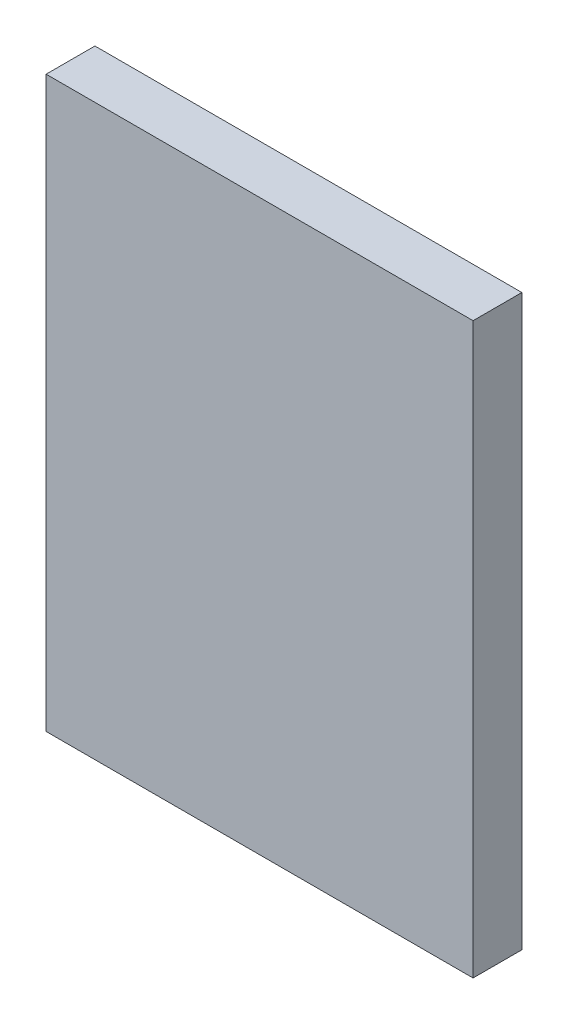
ISO-10303-21;
HEADER;
FILE_DESCRIPTION(('STEP AP214'),'2;1');
FILE_NAME('part.step','',(''),(''),'','','');
FILE_SCHEMA(('AUTOMOTIVE_DESIGN { 1 0 10303 214 1 1 1 1 }'));
ENDSEC;
DATA;
#1=APPLICATION_CONTEXT('core data for automotive mechanical design processes');
#2=APPLICATION_PROTOCOL_DEFINITION('international standard','automotive_design',2000,#1);
#3=PRODUCT_CONTEXT('',#1,'mechanical');
#4=PRODUCT('Part','Part','',(#3));
#5=PRODUCT_RELATED_PRODUCT_CATEGORY('part','',(#4));
#6=PRODUCT_DEFINITION_FORMATION('','',#4);
#7=PRODUCT_DEFINITION_CONTEXT('part definition',#1,'design');
#8=PRODUCT_DEFINITION('design','',#6,#7);
#9=PRODUCT_DEFINITION_SHAPE('','',#8);
#10=(LENGTH_UNIT() NAMED_UNIT(*) SI_UNIT(.MILLI.,.METRE.));
#11=(NAMED_UNIT(*) PLANE_ANGLE_UNIT() SI_UNIT($,.RADIAN.));
#12=(NAMED_UNIT(*) SI_UNIT($,.STERADIAN.) SOLID_ANGLE_UNIT());
#13=UNCERTAINTY_MEASURE_WITH_UNIT(LENGTH_MEASURE(1.E-05),#10,'distance_accuracy_value','');
#14=(GEOMETRIC_REPRESENTATION_CONTEXT(3) GLOBAL_UNCERTAINTY_ASSIGNED_CONTEXT((#13)) GLOBAL_UNIT_ASSIGNED_CONTEXT((#10,
#11,#12)) REPRESENTATION_CONTEXT('',''));
#15=CARTESIAN_POINT('',(0.,0.,0.));
#16=DIRECTION('',(0.,0.,1.));
#17=DIRECTION('',(1.,0.,0.));
#18=AXIS2_PLACEMENT_3D('',#15,#16,#17);
#19=CARTESIAN_POINT('',(6.278,9.413,0.76487));
#20=DIRECTION('',(0.,0.,-1.));
#21=DIRECTION('',(-1.,0.,0.));
#22=AXIS2_PLACEMENT_3D('',#19,#20,#21);
#23=PLANE('',#22);
#24=DIRECTION('',(1.,0.,0.));
#25=VECTOR('',#24,1.);
#26=CARTESIAN_POINT('',(6.128,9.613,0.76487));
#27=LINE('',#26,#25);
#28=CARTESIAN_POINT('',(6.128,9.613,0.76487));
#29=VERTEX_POINT('',#28);
#30=CARTESIAN_POINT('',(6.428,9.613,0.76487));
#31=VERTEX_POINT('',#30);
#32=EDGE_CURVE('E55',#29,#31,#27,.T.);
#33=ORIENTED_EDGE('',*,*,#32,.T.);
#34=DIRECTION('',(0.,1.,0.));
#35=VECTOR('',#34,1.);
#36=CARTESIAN_POINT('',(6.428,9.613,0.76487));
#37=LINE('',#36,#35);
#38=CARTESIAN_POINT('',(6.428,9.213,0.76487));
#39=VERTEX_POINT('',#38);
#40=EDGE_CURVE('E57',#31,#39,#37,.F.);
#41=ORIENTED_EDGE('',*,*,#40,.T.);
#42=DIRECTION('',(1.,0.,0.));
#43=VECTOR('',#42,1.);
#44=CARTESIAN_POINT('',(6.428,9.213,0.76487));
#45=LINE('',#44,#43);
#46=CARTESIAN_POINT('',(6.128,9.213,0.76487));
#47=VERTEX_POINT('',#46);
#48=EDGE_CURVE('E20',#39,#47,#45,.F.);
#49=ORIENTED_EDGE('',*,*,#48,.T.);
#50=DIRECTION('',(0.,1.,0.));
#51=VECTOR('',#50,1.);
#52=CARTESIAN_POINT('',(6.128,9.213,0.76487));
#53=LINE('',#52,#51);
#54=EDGE_CURVE('E80',#47,#29,#53,.T.);
#55=ORIENTED_EDGE('',*,*,#54,.T.);
#56=EDGE_LOOP('',(#33,#41,#49,#55));
#57=FACE_BOUND('',#56,.T.);
#58=ADVANCED_FACE('F17',(#57),#23,.T.);
#59=CARTESIAN_POINT('',(6.428,9.213,0.76487));
#60=DIRECTION('',(0.,1.,0.));
#61=DIRECTION('',(0.,0.,1.));
#62=AXIS2_PLACEMENT_3D('',#59,#60,#61);
#63=PLANE('',#62);
#64=DIRECTION('',(0.,0.,1.));
#65=VECTOR('',#64,1.);
#66=CARTESIAN_POINT('',(6.128,9.213,0.76487));
#67=LINE('',#66,#65);
#68=CARTESIAN_POINT('',(6.128,9.213,0.79916));
#69=VERTEX_POINT('',#68);
#70=EDGE_CURVE('E68',#69,#47,#67,.F.);
#71=ORIENTED_EDGE('',*,*,#70,.T.);
#72=ORIENTED_EDGE('',*,*,#48,.F.);
#73=DIRECTION('',(0.,0.,1.));
#74=VECTOR('',#73,1.);
#75=CARTESIAN_POINT('',(6.428,9.213,0.76487));
#76=LINE('',#75,#74);
#77=CARTESIAN_POINT('',(6.428,9.213,0.79916));
#78=VERTEX_POINT('',#77);
#79=EDGE_CURVE('E63',#39,#78,#76,.T.);
#80=ORIENTED_EDGE('',*,*,#79,.T.);
#81=DIRECTION('',(1.,0.,0.));
#82=VECTOR('',#81,1.);
#83=CARTESIAN_POINT('',(6.278,9.213,0.79916));
#84=LINE('',#83,#82);
#85=EDGE_CURVE('E83',#69,#78,#84,.T.);
#86=ORIENTED_EDGE('',*,*,#85,.F.);
#87=EDGE_LOOP('',(#71,#72,#80,#86));
#88=FACE_BOUND('',#87,.T.);
#89=ADVANCED_FACE('F65',(#88),#63,.F.);
#90=CARTESIAN_POINT('',(6.428,9.613,0.76487));
#91=DIRECTION('',(-1.,0.,0.));
#92=DIRECTION('',(0.,0.,1.));
#93=AXIS2_PLACEMENT_3D('',#90,#91,#92);
#94=PLANE('',#93);
#95=ORIENTED_EDGE('',*,*,#79,.F.);
#96=ORIENTED_EDGE('',*,*,#40,.F.);
#97=DIRECTION('',(0.,0.,-1.));
#98=VECTOR('',#97,1.);
#99=CARTESIAN_POINT('',(6.428,9.613,0.76487));
#100=LINE('',#99,#98);
#101=CARTESIAN_POINT('',(6.428,9.613,0.79916));
#102=VERTEX_POINT('',#101);
#103=EDGE_CURVE('E75',#31,#102,#100,.F.);
#104=ORIENTED_EDGE('',*,*,#103,.T.);
#105=DIRECTION('',(0.,-1.,0.));
#106=VECTOR('',#105,1.);
#107=CARTESIAN_POINT('',(6.428,9.413,0.79916));
#108=LINE('',#107,#106);
#109=EDGE_CURVE('E72',#78,#102,#108,.F.);
#110=ORIENTED_EDGE('',*,*,#109,.F.);
#111=EDGE_LOOP('',(#95,#96,#104,#110));
#112=FACE_BOUND('',#111,.T.);
#113=ADVANCED_FACE('F70',(#112),#94,.F.);
#114=CARTESIAN_POINT('',(6.128,9.613,0.76487));
#115=DIRECTION('',(0.,-1.,0.));
#116=DIRECTION('',(0.,0.,-1.));
#117=AXIS2_PLACEMENT_3D('',#114,#115,#116);
#118=PLANE('',#117);
#119=ORIENTED_EDGE('',*,*,#103,.F.);
#120=ORIENTED_EDGE('',*,*,#32,.F.);
#121=DIRECTION('',(0.,0.,1.));
#122=VECTOR('',#121,1.);
#123=CARTESIAN_POINT('',(6.128,9.613,0.76487));
#124=LINE('',#123,#122);
#125=CARTESIAN_POINT('',(6.128,9.613,0.79916));
#126=VERTEX_POINT('',#125);
#127=EDGE_CURVE('E35',#29,#126,#124,.T.);
#128=ORIENTED_EDGE('',*,*,#127,.T.);
#129=DIRECTION('',(1.,0.,0.));
#130=VECTOR('',#129,1.);
#131=CARTESIAN_POINT('',(6.278,9.613,0.79916));
#132=LINE('',#131,#130);
#133=EDGE_CURVE('E26',#102,#126,#132,.F.);
#134=ORIENTED_EDGE('',*,*,#133,.F.);
#135=EDGE_LOOP('',(#119,#120,#128,#134));
#136=FACE_BOUND('',#135,.T.);
#137=ADVANCED_FACE('F89',(#136),#118,.F.);
#138=CARTESIAN_POINT('',(6.128,9.213,0.76487));
#139=DIRECTION('',(1.,0.,0.));
#140=DIRECTION('',(0.,1.,0.));
#141=AXIS2_PLACEMENT_3D('',#138,#139,#140);
#142=PLANE('',#141);
#143=ORIENTED_EDGE('',*,*,#127,.F.);
#144=ORIENTED_EDGE('',*,*,#54,.F.);
#145=ORIENTED_EDGE('',*,*,#70,.F.);
#146=DIRECTION('',(0.,-1.,0.));
#147=VECTOR('',#146,1.);
#148=CARTESIAN_POINT('',(6.128,9.413,0.79916));
#149=LINE('',#148,#147);
#150=EDGE_CURVE('E11',#126,#69,#149,.T.);
#151=ORIENTED_EDGE('',*,*,#150,.F.);
#152=EDGE_LOOP('',(#143,#144,#145,#151));
#153=FACE_BOUND('',#152,.T.);
#154=ADVANCED_FACE('F91',(#153),#142,.F.);
#155=CARTESIAN_POINT('',(6.278,9.413,0.79916));
#156=DIRECTION('',(0.,0.,1.));
#157=DIRECTION('',(0.,-1.,0.));
#158=AXIS2_PLACEMENT_3D('',#155,#156,#157);
#159=PLANE('',#158);
#160=ORIENTED_EDGE('',*,*,#133,.T.);
#161=ORIENTED_EDGE('',*,*,#150,.T.);
#162=ORIENTED_EDGE('',*,*,#85,.T.);
#163=ORIENTED_EDGE('',*,*,#109,.T.);
#164=EDGE_LOOP('',(#160,#161,#162,#163));
#165=FACE_BOUND('',#164,.T.);
#166=ADVANCED_FACE('F88',(#165),#159,.T.);
#167=CLOSED_SHELL('',(#58,#89,#113,#137,#154,#166));
#168=MANIFOLD_SOLID_BREP('B1',#167);
#169=ADVANCED_BREP_SHAPE_REPRESENTATION('',(#18,#168),#14);
#170=SHAPE_DEFINITION_REPRESENTATION(#9,#169);
ENDSEC;
END-ISO-10303-21;
